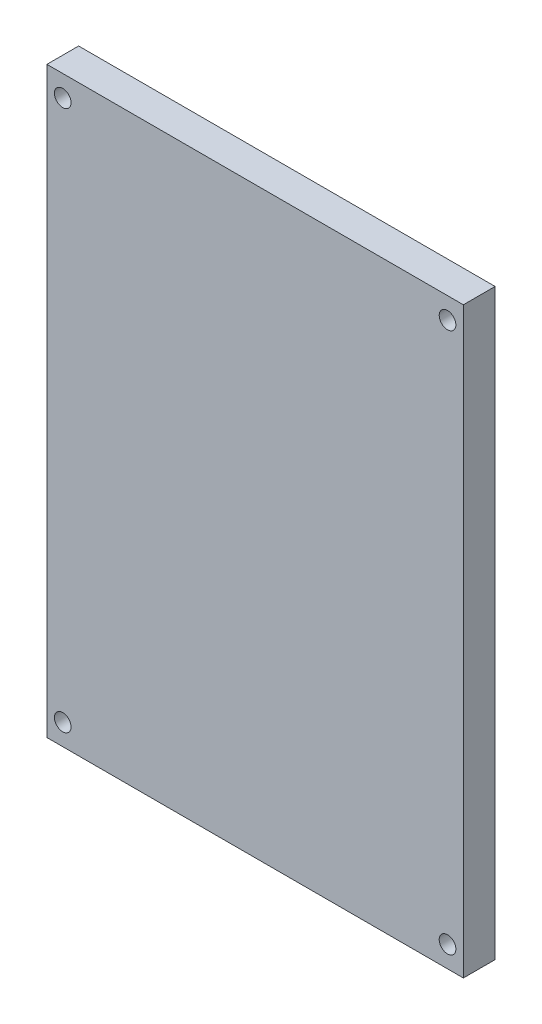
ISO-10303-21;
HEADER;
FILE_DESCRIPTION(('STEP AP214'),'2;1');
FILE_NAME('part.step','',(''),(''),'','','');
FILE_SCHEMA(('AUTOMOTIVE_DESIGN { 1 0 10303 214 1 1 1 1 }'));
ENDSEC;
DATA;
#1=APPLICATION_CONTEXT('core data for automotive mechanical design processes');
#2=APPLICATION_PROTOCOL_DEFINITION('international standard','automotive_design',2000,#1);
#3=PRODUCT_CONTEXT('',#1,'mechanical');
#4=PRODUCT('Part','Part','',(#3));
#5=PRODUCT_RELATED_PRODUCT_CATEGORY('part','',(#4));
#6=PRODUCT_DEFINITION_FORMATION('','',#4);
#7=PRODUCT_DEFINITION_CONTEXT('part definition',#1,'design');
#8=PRODUCT_DEFINITION('design','',#6,#7);
#9=PRODUCT_DEFINITION_SHAPE('','',#8);
#10=(LENGTH_UNIT() NAMED_UNIT(*) SI_UNIT(.MILLI.,.METRE.));
#11=(NAMED_UNIT(*) PLANE_ANGLE_UNIT() SI_UNIT($,.RADIAN.));
#12=(NAMED_UNIT(*) SI_UNIT($,.STERADIAN.) SOLID_ANGLE_UNIT());
#13=UNCERTAINTY_MEASURE_WITH_UNIT(LENGTH_MEASURE(1.E-05),#10,'distance_accuracy_value','');
#14=(GEOMETRIC_REPRESENTATION_CONTEXT(3) GLOBAL_UNCERTAINTY_ASSIGNED_CONTEXT((#13)) GLOBAL_UNIT_ASSIGNED_CONTEXT((#10,
#11,#12)) REPRESENTATION_CONTEXT('',''));
#15=CARTESIAN_POINT('',(0.,0.,0.));
#16=DIRECTION('',(0.,0.,1.));
#17=DIRECTION('',(1.,0.,0.));
#18=AXIS2_PLACEMENT_3D('',#15,#16,#17);
#19=CARTESIAN_POINT('',(-46.8216867469879,28.9192771084337,3.81));
#20=DIRECTION('',(1.,0.,0.));
#21=DIRECTION('',(0.,1.,0.));
#22=AXIS2_PLACEMENT_3D('',#19,#20,#21);
#23=PLANE('',#22);
#24=DIRECTION('',(0.,-1.,0.));
#25=VECTOR('',#24,1.);
#26=CARTESIAN_POINT('',(-46.8216867469879,28.9192771084337,0.));
#27=LINE('',#26,#25);
#28=CARTESIAN_POINT('',(-46.8216867469879,28.9192771084337,0.));
#29=VERTEX_POINT('',#28);
#30=CARTESIAN_POINT('',(-46.8216867469879,-41.0807228915663,0.));
#31=VERTEX_POINT('',#30);
#32=EDGE_CURVE('E98',#29,#31,#27,.T.);
#33=ORIENTED_EDGE('',*,*,#32,.T.);
#34=DIRECTION('',(0.,0.,-1.));
#35=VECTOR('',#34,1.);
#36=CARTESIAN_POINT('',(-46.8216867469879,-41.0807228915663,3.81));
#37=LINE('',#36,#35);
#38=CARTESIAN_POINT('',(-46.8216867469879,-41.0807228915663,3.81));
#39=VERTEX_POINT('',#38);
#40=EDGE_CURVE('E11',#39,#31,#37,.T.);
#41=ORIENTED_EDGE('',*,*,#40,.F.);
#42=DIRECTION('',(0.,-1.,0.));
#43=VECTOR('',#42,1.);
#44=CARTESIAN_POINT('',(-46.8216867469879,28.9192771084337,3.81));
#45=LINE('',#44,#43);
#46=CARTESIAN_POINT('',(-46.8216867469879,28.9192771084337,3.81));
#47=VERTEX_POINT('',#46);
#48=EDGE_CURVE('E86',#47,#39,#45,.T.);
#49=ORIENTED_EDGE('',*,*,#48,.F.);
#50=DIRECTION('',(0.,0.,-1.));
#51=VECTOR('',#50,1.);
#52=CARTESIAN_POINT('',(-46.8216867469879,28.9192771084337,3.81));
#53=LINE('',#52,#51);
#54=EDGE_CURVE('E94',#47,#29,#53,.T.);
#55=ORIENTED_EDGE('',*,*,#54,.T.);
#56=EDGE_LOOP('',(#33,#41,#49,#55));
#57=FACE_BOUND('',#56,.T.);
#58=ADVANCED_FACE('F35',(#57),#23,.F.);
#59=CARTESIAN_POINT('',(-46.8216867469879,-41.0807228915663,3.81));
#60=DIRECTION('',(0.,1.,0.));
#61=DIRECTION('',(0.,0.,1.));
#62=AXIS2_PLACEMENT_3D('',#59,#60,#61);
#63=PLANE('',#62);
#64=DIRECTION('',(1.,0.,0.));
#65=VECTOR('',#64,1.);
#66=CARTESIAN_POINT('',(-46.8216867469879,-41.0807228915663,0.));
#67=LINE('',#66,#65);
#68=CARTESIAN_POINT('',(3.17831325301209,-41.0807228915663,0.));
#69=VERTEX_POINT('',#68);
#70=EDGE_CURVE('E90',#31,#69,#67,.T.);
#71=ORIENTED_EDGE('',*,*,#70,.T.);
#72=DIRECTION('',(0.,0.,-1.));
#73=VECTOR('',#72,1.);
#74=CARTESIAN_POINT('',(3.17831325301209,-41.0807228915663,3.81));
#75=LINE('',#74,#73);
#76=CARTESIAN_POINT('',(3.17831325301209,-41.0807228915663,3.81));
#77=VERTEX_POINT('',#76);
#78=EDGE_CURVE('E43',#77,#69,#75,.T.);
#79=ORIENTED_EDGE('',*,*,#78,.F.);
#80=DIRECTION('',(1.,0.,0.));
#81=VECTOR('',#80,1.);
#82=CARTESIAN_POINT('',(-46.8216867469879,-41.0807228915663,3.81));
#83=LINE('',#82,#81);
#84=EDGE_CURVE('E81',#39,#77,#83,.T.);
#85=ORIENTED_EDGE('',*,*,#84,.F.);
#86=ORIENTED_EDGE('',*,*,#40,.T.);
#87=EDGE_LOOP('',(#71,#79,#85,#86));
#88=FACE_BOUND('',#87,.T.);
#89=ADVANCED_FACE('F89',(#88),#63,.F.);
#90=CARTESIAN_POINT('',(3.17831325301207,28.9192771084337,3.81));
#91=DIRECTION('',(-1.,0.,0.));
#92=DIRECTION('',(0.,-1.,0.));
#93=AXIS2_PLACEMENT_3D('',#90,#91,#92);
#94=PLANE('',#93);
#95=DIRECTION('',(0.,1.,0.));
#96=VECTOR('',#95,1.);
#97=CARTESIAN_POINT('',(3.17831325301207,28.9192771084337,0.));
#98=LINE('',#97,#96);
#99=CARTESIAN_POINT('',(3.17831325301207,28.9192771084337,0.));
#100=VERTEX_POINT('',#99);
#101=EDGE_CURVE('E68',#69,#100,#98,.T.);
#102=ORIENTED_EDGE('',*,*,#101,.T.);
#103=DIRECTION('',(0.,0.,-1.));
#104=VECTOR('',#103,1.);
#105=CARTESIAN_POINT('',(3.17831325301207,28.9192771084337,3.81));
#106=LINE('',#105,#104);
#107=CARTESIAN_POINT('',(3.17831325301207,28.9192771084337,3.81));
#108=VERTEX_POINT('',#107);
#109=EDGE_CURVE('E91',#108,#100,#106,.T.);
#110=ORIENTED_EDGE('',*,*,#109,.F.);
#111=DIRECTION('',(0.,1.,0.));
#112=VECTOR('',#111,1.);
#113=CARTESIAN_POINT('',(3.17831325301207,28.9192771084337,3.81));
#114=LINE('',#113,#112);
#115=EDGE_CURVE('E84',#77,#108,#114,.T.);
#116=ORIENTED_EDGE('',*,*,#115,.F.);
#117=ORIENTED_EDGE('',*,*,#78,.T.);
#118=EDGE_LOOP('',(#102,#110,#116,#117));
#119=FACE_BOUND('',#118,.T.);
#120=ADVANCED_FACE('F92',(#119),#94,.F.);
#121=CARTESIAN_POINT('',(-46.8216867469879,28.9192771084337,3.81));
#122=DIRECTION('',(0.,-1.,0.));
#123=DIRECTION('',(0.,0.,-1.));
#124=AXIS2_PLACEMENT_3D('',#121,#122,#123);
#125=PLANE('',#124);
#126=DIRECTION('',(-1.,0.,0.));
#127=VECTOR('',#126,1.);
#128=CARTESIAN_POINT('',(-46.8216867469879,28.9192771084337,0.));
#129=LINE('',#128,#127);
#130=EDGE_CURVE('E74',#100,#29,#129,.T.);
#131=ORIENTED_EDGE('',*,*,#130,.T.);
#132=ORIENTED_EDGE('',*,*,#54,.F.);
#133=DIRECTION('',(-1.,0.,0.));
#134=VECTOR('',#133,1.);
#135=CARTESIAN_POINT('',(-46.8216867469879,28.9192771084337,3.81));
#136=LINE('',#135,#134);
#137=EDGE_CURVE('E51',#108,#47,#136,.T.);
#138=ORIENTED_EDGE('',*,*,#137,.F.);
#139=ORIENTED_EDGE('',*,*,#109,.T.);
#140=EDGE_LOOP('',(#131,#132,#138,#139));
#141=FACE_BOUND('',#140,.T.);
#142=ADVANCED_FACE('F106',(#141),#125,.F.);
#143=CARTESIAN_POINT('',(0.,0.,3.81));
#144=DIRECTION('',(0.,0.,1.));
#145=DIRECTION('',(1.,0.,0.));
#146=AXIS2_PLACEMENT_3D('',#143,#144,#145);
#147=PLANE('',#146);
#148=CARTESIAN_POINT('',(-44.9216867469879,-38.5306161784303,3.81));
#149=DIRECTION('',(0.,0.,1.));
#150=DIRECTION('',(-1.,0.,0.));
#151=AXIS2_PLACEMENT_3D('',#148,#149,#150);
#152=CIRCLE('',#151,1.00000000000005);
#153=CARTESIAN_POINT('',(-45.921686746988,-38.5306161784303,3.81));
#154=VERTEX_POINT('',#153);
#155=EDGE_CURVE('E122',#154,#154,#152,.T.);
#156=ORIENTED_EDGE('',*,*,#155,.F.);
#157=EDGE_LOOP('',(#156));
#158=FACE_BOUND('',#157,.T.);
#159=CARTESIAN_POINT('',(1.27831325301209,-38.5306161784303,3.81));
#160=DIRECTION('',(0.,0.,1.));
#161=DIRECTION('',(1.,0.,0.));
#162=AXIS2_PLACEMENT_3D('',#159,#160,#161);
#163=CIRCLE('',#162,1.00000000000005);
#164=CARTESIAN_POINT('',(2.27831325301214,-38.5306161784303,3.81));
#165=VERTEX_POINT('',#164);
#166=EDGE_CURVE('E121',#165,#165,#163,.T.);
#167=ORIENTED_EDGE('',*,*,#166,.F.);
#168=EDGE_LOOP('',(#167));
#169=FACE_BOUND('',#168,.T.);
#170=CARTESIAN_POINT('',(1.27831325301209,26.3691703952978,3.81));
#171=DIRECTION('',(0.,0.,1.));
#172=DIRECTION('',(-1.,0.,0.));
#173=AXIS2_PLACEMENT_3D('',#170,#171,#172);
#174=CIRCLE('',#173,1.00000000000005);
#175=CARTESIAN_POINT('',(0.278313253012045,26.3691703952978,3.81));
#176=VERTEX_POINT('',#175);
#177=EDGE_CURVE('E128',#176,#176,#174,.T.);
#178=ORIENTED_EDGE('',*,*,#177,.F.);
#179=EDGE_LOOP('',(#178));
#180=FACE_BOUND('',#179,.T.);
#181=CARTESIAN_POINT('',(-44.9216867469879,26.3691703952978,3.81));
#182=DIRECTION('',(0.,0.,1.));
#183=DIRECTION('',(1.,0.,0.));
#184=AXIS2_PLACEMENT_3D('',#181,#182,#183);
#185=CIRCLE('',#184,1.00000000000005);
#186=CARTESIAN_POINT('',(-43.9216867469879,26.3691703952978,3.81));
#187=VERTEX_POINT('',#186);
#188=EDGE_CURVE('E114',#187,#187,#185,.T.);
#189=ORIENTED_EDGE('',*,*,#188,.F.);
#190=EDGE_LOOP('',(#189));
#191=FACE_BOUND('',#190,.T.);
#192=ORIENTED_EDGE('',*,*,#48,.T.);
#193=ORIENTED_EDGE('',*,*,#84,.T.);
#194=ORIENTED_EDGE('',*,*,#115,.T.);
#195=ORIENTED_EDGE('',*,*,#137,.T.);
#196=EDGE_LOOP('',(#192,#193,#194,#195));
#197=FACE_BOUND('',#196,.T.);
#198=ADVANCED_FACE('F82',(#158,#169,#180,#191,#197),#147,.T.);
#199=CARTESIAN_POINT('',(0.,0.,0.));
#200=DIRECTION('',(0.,0.,1.));
#201=DIRECTION('',(1.,0.,0.));
#202=AXIS2_PLACEMENT_3D('',#199,#200,#201);
#203=PLANE('',#202);
#204=CARTESIAN_POINT('',(-44.9216867469879,-38.5306161784303,0.));
#205=DIRECTION('',(0.,0.,1.));
#206=DIRECTION('',(1.,0.,0.));
#207=AXIS2_PLACEMENT_3D('',#204,#205,#206);
#208=CIRCLE('',#207,1.00000000000005);
#209=CARTESIAN_POINT('',(-43.9216867469879,-38.5306161784303,0.));
#210=VERTEX_POINT('',#209);
#211=EDGE_CURVE('E118',#210,#210,#208,.F.);
#212=ORIENTED_EDGE('',*,*,#211,.F.);
#213=EDGE_LOOP('',(#212));
#214=FACE_BOUND('',#213,.T.);
#215=CARTESIAN_POINT('',(1.27831325301209,-38.5306161784303,0.));
#216=DIRECTION('',(0.,0.,1.));
#217=DIRECTION('',(1.,0.,0.));
#218=AXIS2_PLACEMENT_3D('',#215,#216,#217);
#219=CIRCLE('',#218,1.00000000000005);
#220=CARTESIAN_POINT('',(2.27831325301214,-38.5306161784303,0.));
#221=VERTEX_POINT('',#220);
#222=EDGE_CURVE('E125',#221,#221,#219,.F.);
#223=ORIENTED_EDGE('',*,*,#222,.F.);
#224=EDGE_LOOP('',(#223));
#225=FACE_BOUND('',#224,.T.);
#226=CARTESIAN_POINT('',(1.27831325301209,26.3691703952978,0.));
#227=DIRECTION('',(0.,0.,1.));
#228=DIRECTION('',(1.,0.,0.));
#229=AXIS2_PLACEMENT_3D('',#226,#227,#228);
#230=CIRCLE('',#229,1.00000000000005);
#231=CARTESIAN_POINT('',(2.27831325301214,26.3691703952978,0.));
#232=VERTEX_POINT('',#231);
#233=EDGE_CURVE('E117',#232,#232,#230,.F.);
#234=ORIENTED_EDGE('',*,*,#233,.F.);
#235=EDGE_LOOP('',(#234));
#236=FACE_BOUND('',#235,.T.);
#237=CARTESIAN_POINT('',(-44.9216867469879,26.3691703952978,0.));
#238=DIRECTION('',(0.,0.,1.));
#239=DIRECTION('',(1.,0.,0.));
#240=AXIS2_PLACEMENT_3D('',#237,#238,#239);
#241=CIRCLE('',#240,1.00000000000005);
#242=CARTESIAN_POINT('',(-43.9216867469879,26.3691703952978,0.));
#243=VERTEX_POINT('',#242);
#244=EDGE_CURVE('E101',#243,#243,#241,.F.);
#245=ORIENTED_EDGE('',*,*,#244,.F.);
#246=EDGE_LOOP('',(#245));
#247=FACE_BOUND('',#246,.T.);
#248=ORIENTED_EDGE('',*,*,#32,.F.);
#249=ORIENTED_EDGE('',*,*,#130,.F.);
#250=ORIENTED_EDGE('',*,*,#101,.F.);
#251=ORIENTED_EDGE('',*,*,#70,.F.);
#252=EDGE_LOOP('',(#248,#249,#250,#251));
#253=FACE_BOUND('',#252,.T.);
#254=ADVANCED_FACE('F109',(#214,#225,#236,#247,#253),#203,.F.);
#255=CARTESIAN_POINT('',(-44.9216867469879,26.3691703952978,-2.82842712474633));
#256=DIRECTION('',(0.,0.,1.));
#257=DIRECTION('',(1.,0.,0.));
#258=AXIS2_PLACEMENT_3D('',#255,#256,#257);
#259=CYLINDRICAL_SURFACE('',#258,1.00000000000005);
#260=ORIENTED_EDGE('',*,*,#244,.T.);
#261=EDGE_LOOP('',(#260));
#262=FACE_BOUND('',#261,.T.);
#263=ORIENTED_EDGE('',*,*,#188,.T.);
#264=EDGE_LOOP('',(#263));
#265=FACE_BOUND('',#264,.T.);
#266=ADVANCED_FACE('F144',(#262,#265),#259,.F.);
#267=CARTESIAN_POINT('',(1.27831325301209,26.3691703952978,-2.82842712474633));
#268=DIRECTION('',(0.,0.,1.));
#269=DIRECTION('',(1.,0.,0.));
#270=AXIS2_PLACEMENT_3D('',#267,#268,#269);
#271=CYLINDRICAL_SURFACE('',#270,1.00000000000005);
#272=ORIENTED_EDGE('',*,*,#233,.T.);
#273=EDGE_LOOP('',(#272));
#274=FACE_BOUND('',#273,.T.);
#275=ORIENTED_EDGE('',*,*,#177,.T.);
#276=EDGE_LOOP('',(#275));
#277=FACE_BOUND('',#276,.T.);
#278=ADVANCED_FACE('F136',(#274,#277),#271,.F.);
#279=CARTESIAN_POINT('',(1.27831325301209,-38.5306161784303,-2.82842712474633));
#280=DIRECTION('',(0.,0.,1.));
#281=DIRECTION('',(1.,0.,0.));
#282=AXIS2_PLACEMENT_3D('',#279,#280,#281);
#283=CYLINDRICAL_SURFACE('',#282,1.00000000000005);
#284=ORIENTED_EDGE('',*,*,#222,.T.);
#285=EDGE_LOOP('',(#284));
#286=FACE_BOUND('',#285,.T.);
#287=ORIENTED_EDGE('',*,*,#166,.T.);
#288=EDGE_LOOP('',(#287));
#289=FACE_BOUND('',#288,.T.);
#290=ADVANCED_FACE('F152',(#286,#289),#283,.F.);
#291=CARTESIAN_POINT('',(-44.9216867469879,-38.5306161784303,-2.82842712474633));
#292=DIRECTION('',(0.,0.,1.));
#293=DIRECTION('',(1.,0.,0.));
#294=AXIS2_PLACEMENT_3D('',#291,#292,#293);
#295=CYLINDRICAL_SURFACE('',#294,1.00000000000005);
#296=ORIENTED_EDGE('',*,*,#211,.T.);
#297=EDGE_LOOP('',(#296));
#298=FACE_BOUND('',#297,.T.);
#299=ORIENTED_EDGE('',*,*,#155,.T.);
#300=EDGE_LOOP('',(#299));
#301=FACE_BOUND('',#300,.T.);
#302=ADVANCED_FACE('F199',(#298,#301),#295,.F.);
#303=CLOSED_SHELL('',(#58,#89,#120,#142,#198,#254,#266,#278,#290,#302));
#304=MANIFOLD_SOLID_BREP('B2',#303);
#305=ADVANCED_BREP_SHAPE_REPRESENTATION('',(#18,#304),#14);
#306=SHAPE_DEFINITION_REPRESENTATION(#9,#305);
ENDSEC;
END-ISO-10303-21;
